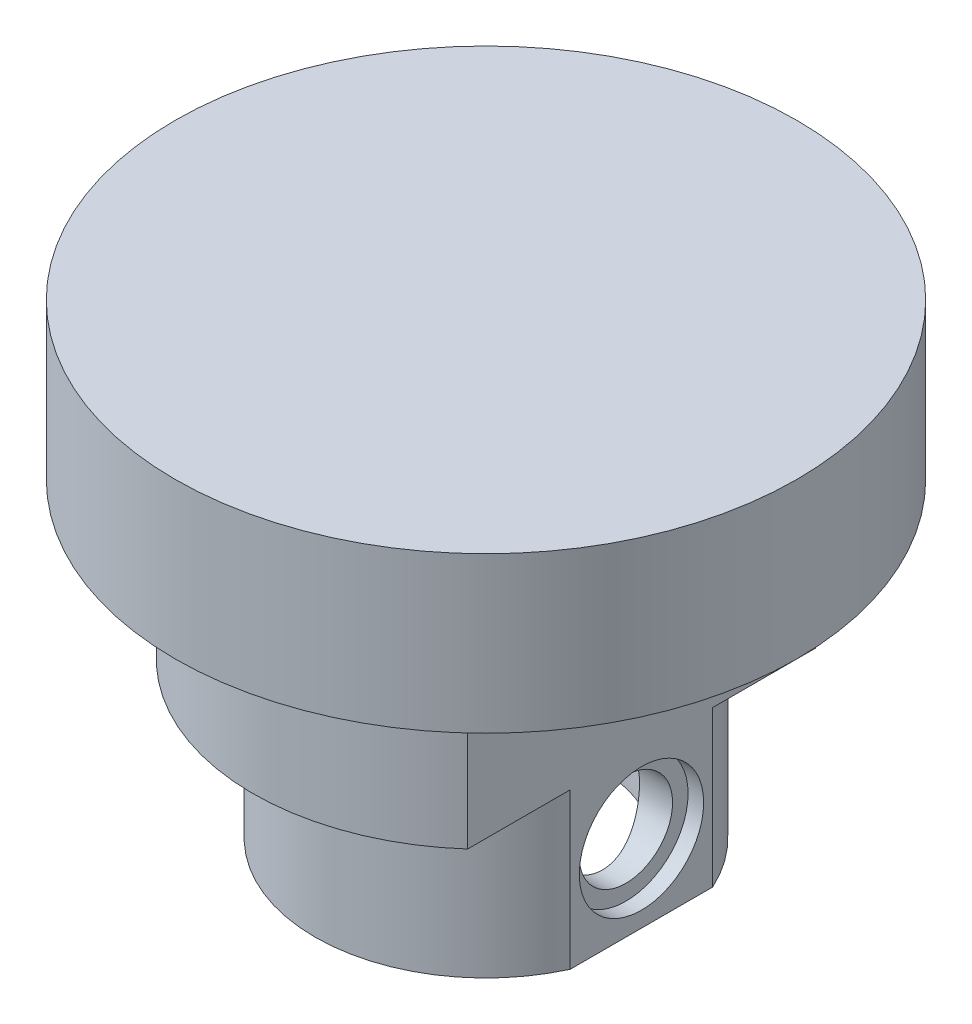
ISO-10303-21;
HEADER;
FILE_DESCRIPTION(('STEP AP214'),'2;1');
FILE_NAME('part.step','',(''),(''),'','','');
FILE_SCHEMA(('AUTOMOTIVE_DESIGN { 1 0 10303 214 1 1 1 1 }'));
ENDSEC;
DATA;
#1=APPLICATION_CONTEXT('core data for automotive mechanical design processes');
#2=APPLICATION_PROTOCOL_DEFINITION('international standard','automotive_design',2000,#1);
#3=PRODUCT_CONTEXT('',#1,'mechanical');
#4=PRODUCT('Part','Part','',(#3));
#5=PRODUCT_RELATED_PRODUCT_CATEGORY('part','',(#4));
#6=PRODUCT_DEFINITION_FORMATION('','',#4);
#7=PRODUCT_DEFINITION_CONTEXT('part definition',#1,'design');
#8=PRODUCT_DEFINITION('design','',#6,#7);
#9=PRODUCT_DEFINITION_SHAPE('','',#8);
#10=(LENGTH_UNIT() NAMED_UNIT(*) SI_UNIT(.MILLI.,.METRE.));
#11=(NAMED_UNIT(*) PLANE_ANGLE_UNIT() SI_UNIT($,.RADIAN.));
#12=(NAMED_UNIT(*) SI_UNIT($,.STERADIAN.) SOLID_ANGLE_UNIT());
#13=UNCERTAINTY_MEASURE_WITH_UNIT(LENGTH_MEASURE(1.E-05),#10,'distance_accuracy_value','');
#14=(GEOMETRIC_REPRESENTATION_CONTEXT(3) GLOBAL_UNCERTAINTY_ASSIGNED_CONTEXT((#13)) GLOBAL_UNIT_ASSIGNED_CONTEXT((#10,
#11,#12)) REPRESENTATION_CONTEXT('',''));
#15=CARTESIAN_POINT('',(0.,0.,0.));
#16=DIRECTION('',(0.,0.,1.));
#17=DIRECTION('',(1.,0.,0.));
#18=AXIS2_PLACEMENT_3D('',#15,#16,#17);
#19=CARTESIAN_POINT('',(-22.001,-25.,0.));
#20=DIRECTION('',(1.,0.,0.));
#21=DIRECTION('',(0.,0.,-1.));
#22=AXIS2_PLACEMENT_3D('',#19,#20,#21);
#23=CYLINDRICAL_SURFACE('',#22,3.);
#24=CARTESIAN_POINT('',(6.87386354243376,-25.,-3.));
#25=CARTESIAN_POINT('',(6.87387034169605,-25.1606855345694,-2.99999310102034));
#26=CARTESIAN_POINT('',(6.87957650695683,-25.3216394414978,-2.9870126033011));
#27=CARTESIAN_POINT('',(6.901666249599,-25.6389086261494,-2.93560066312235));
#28=CARTESIAN_POINT('',(6.9180771094252,-25.7952109815078,-2.89710418548511));
#29=CARTESIAN_POINT('',(6.95940616078833,-26.0980777134562,-2.79635331714323));
#30=CARTESIAN_POINT('',(6.98429226391323,-26.2446763649368,-2.73418843497826));
#31=CARTESIAN_POINT('',(7.0397201578331,-26.5253280322934,-2.58813019791229));
#32=CARTESIAN_POINT('',(7.07026071330917,-26.6593837787862,-2.5042415873656));
#33=CARTESIAN_POINT('',(7.13551292343503,-26.9188904718165,-2.31198302134881));
#34=CARTESIAN_POINT('',(7.17035875533908,-27.0435345990959,-2.20256905254827));
#35=CARTESIAN_POINT('',(7.23918686872916,-27.2732935312837,-1.96456364269823));
#36=CARTESIAN_POINT('',(7.27316884487642,-27.3784015115646,-1.83596552816021));
#37=CARTESIAN_POINT('',(7.33805111462092,-27.5701095854646,-1.55700947005955));
#38=CARTESIAN_POINT('',(7.36877705418855,-27.6558164495289,-1.40599344962864));
#39=CARTESIAN_POINT('',(7.42205891553774,-27.8002653552607,-1.09023798310296));
#40=CARTESIAN_POINT('',(7.44461816104874,-27.8590183693733,-0.925504153615326));
#41=CARTESIAN_POINT('',(7.47807487485913,-27.9450122289896,-0.595449640559632));
#42=CARTESIAN_POINT('',(7.48948405155942,-27.9736409709553,-0.430543477287476));
#43=CARTESIAN_POINT('',(7.50120466031146,-28.0030427286722,-0.0978994928759445));
#44=CARTESIAN_POINT('',(7.50152023155834,-28.0038261339487,0.0698372487591155));
#45=CARTESIAN_POINT('',(7.49132944230918,-27.9782758452937,0.393348742053132));
#46=CARTESIAN_POINT('',(7.48142995157228,-27.9534628408679,0.549266179305684));
#47=CARTESIAN_POINT('',(7.45273937203712,-27.8800106855455,0.854509663832869));
#48=CARTESIAN_POINT('',(7.43394763082012,-27.8313697864023,1.00383522658686));
#49=CARTESIAN_POINT('',(7.388952366862,-27.7110452756826,1.29434690776583));
#50=CARTESIAN_POINT('',(7.36264140699335,-27.6390254277769,1.43537643506834));
#51=CARTESIAN_POINT('',(7.30521877770412,-27.4743024896213,1.70371222611196));
#52=CARTESIAN_POINT('',(7.27410546400724,-27.3815923103498,1.83101376407694));
#53=CARTESIAN_POINT('',(7.20782455764184,-27.1710262960842,2.07715324198526));
#54=CARTESIAN_POINT('',(7.17252489767638,-27.0519191611408,2.19488676789948));
#55=CARTESIAN_POINT('',(7.10342491459894,-26.795514142252,2.40916112308897));
#56=CARTESIAN_POINT('',(7.06962508512115,-26.6582103277066,2.50569501568047));
#57=CARTESIAN_POINT('',(7.00645346113535,-26.3643714664391,2.67735628307891));
#58=CARTESIAN_POINT('',(6.97723371086562,-26.207402754492,2.75180197745439));
#59=CARTESIAN_POINT('',(6.92831385516127,-25.8816767645317,2.87276438979969));
#60=CARTESIAN_POINT('',(6.90860756836966,-25.7129272229101,2.91929924756697));
#61=CARTESIAN_POINT('',(6.88244639554074,-25.3794463337989,2.98043242328234));
#62=CARTESIAN_POINT('',(6.87525549684207,-25.2150993293072,2.99680814522181));
#63=CARTESIAN_POINT('',(6.87284246803558,-24.8858841883607,3.00234198966433));
#64=CARTESIAN_POINT('',(6.87761670840543,-24.7210162250865,2.99150836588693));
#65=CARTESIAN_POINT('',(6.8978406653867,-24.4053115975646,2.94454934218505));
#66=CARTESIAN_POINT('',(6.91266686697452,-24.2542105938999,2.90989959303579));
#67=CARTESIAN_POINT('',(6.9505507654101,-23.9600673928218,2.81820628036631));
#68=CARTESIAN_POINT('',(6.97361028732897,-23.8170269903393,2.76115775145341));
#69=CARTESIAN_POINT('',(7.02650672790152,-23.5365964633065,2.62370345922236));
#70=CARTESIAN_POINT('',(7.05658056958766,-23.3996707169582,2.54244430239697));
#71=CARTESIAN_POINT('',(7.11975577736692,-23.1407755188376,2.35974783666273));
#72=CARTESIAN_POINT('',(7.15285837344067,-23.0188121908068,2.25830231022284));
#73=CARTESIAN_POINT('',(7.22131373957124,-22.7839398871009,2.02926631752087));
#74=CARTESIAN_POINT('',(7.2566521092785,-22.6723651520626,1.90029814416816));
#75=CARTESIAN_POINT('',(7.32329691851298,-22.4722343850853,1.62462545005276));
#76=CARTESIAN_POINT('',(7.35460319389703,-22.3836792901073,1.47792020769992));
#77=CARTESIAN_POINT('',(7.40975573850585,-22.232428560305,1.17041990100452));
#78=CARTESIAN_POINT('',(7.4336037936099,-22.1697267337395,1.00962822149812));
#79=CARTESIAN_POINT('',(7.47109070203356,-22.0726767214004,0.678590386371823));
#80=CARTESIAN_POINT('',(7.48473509559155,-22.038313147884,0.50834941541523));
#81=CARTESIAN_POINT('',(7.49968512317788,-22.0007429475207,0.175224765543923));
#82=CARTESIAN_POINT('',(7.50173770124618,-21.995649807157,0.0125857389781306));
#83=CARTESIAN_POINT('',(7.49529063560582,-22.0117832190752,-0.311150753688398));
#84=CARTESIAN_POINT('',(7.48679258923161,-22.0330057872334,-0.472248449421579));
#85=CARTESIAN_POINT('',(7.46057270072754,-22.0998201819998,-0.783256352600094));
#86=CARTESIAN_POINT('',(7.44314221048496,-22.1446434171348,-0.9333582057973));
#87=CARTESIAN_POINT('',(7.40092421651037,-22.2565792088216,-1.2238835333139));
#88=CARTESIAN_POINT('',(7.37613535594289,-22.3236958764086,-1.36430521678368));
#89=CARTESIAN_POINT('',(7.32027141917801,-22.4816547900299,-1.63830455820773));
#90=CARTESIAN_POINT('',(7.288966960308,-22.5734144129877,-1.77130556278107));
#91=CARTESIAN_POINT('',(7.2238410334062,-22.7766828081205,-2.0205810602219));
#92=CARTESIAN_POINT('',(7.19001852696379,-22.8881997544123,-2.13684859379602));
#93=CARTESIAN_POINT('',(7.1210665105152,-23.135972720273,-2.35680182841674));
#94=CARTESIAN_POINT('',(7.08598570842144,-23.2733328627161,-2.45926306504163));
#95=CARTESIAN_POINT('',(7.02074485276124,-23.5644136535812,-2.63977144144724));
#96=CARTESIAN_POINT('',(6.99058537793172,-23.7181362226803,-2.71781571083651));
#97=CARTESIAN_POINT('',(6.94138371358595,-24.0235542797053,-2.84098572677451));
#98=CARTESIAN_POINT('',(6.92158645020622,-24.1741924040687,-2.88843803497901));
#99=CARTESIAN_POINT('',(6.89168739051179,-24.481733562239,-2.95907986392734));
#100=CARTESIAN_POINT('',(6.88155858435653,-24.6386178601365,-2.98233699287412));
#101=CARTESIAN_POINT('',(6.87587645913135,-24.8301673586673,-2.99538303278269));
#102=CARTESIAN_POINT('',(6.87512296675926,-24.8641022205346,-2.99711296127843));
#103=CARTESIAN_POINT('',(6.87411577084084,-24.9320207151958,-2.99942221686375));
#104=CARTESIAN_POINT('',(6.8738621039388,-24.9660043513827,-3.0000014595918));
#105=CARTESIAN_POINT('',(6.87386354243376,-25.,-3.));
#106=B_SPLINE_CURVE_WITH_KNOTS('',3,(#24,#25,#26,#27,#28,#29,#30,#31,#32,#33,#34,#35,#36,#37,
#38,#39,#40,#41,#42,#43,#44,#45,#46,#47,#48,#49,#50,#51,#52,#53,#54,#55,#56,#57,#58,#59,#60,#61,
#62,#63,#64,#65,#66,#67,#68,#69,#70,#71,#72,#73,#74,#75,#76,#77,#78,#79,#80,#81,#82,#83,#84,#85,
#86,#87,#88,#89,#90,#91,#92,#93,#94,#95,#96,#97,#98,#99,#100,#101,#102,#103,#104,#105),
.UNSPECIFIED.,.T.,.F.,(4,2,2,2,2,2,2,2,2,2,2,2,2,2,2,2,2,2,2,2,2,2,2,2,2,2,2,2,2,2,2,2,2,2,2,2,
2,2,2,2,4),(0.,0.481916473151481,0.965066003733366,1.44640623494008,1.92764143235791,
2.43383427426637,2.94020361522513,3.46654003637142,3.9926620045422,4.49331274330775,
4.99377667958508,5.46612967245453,5.93851732693589,6.41802450352347,6.89769622410046,
7.40886066122033,7.9201921069069,8.44596688075886,8.97139957200151,9.4647322128663,
9.95791522361909,10.4230087212772,10.8882053797746,11.3722673197905,11.8565267178877,
12.3765560137047,12.8966064727912,13.4165323096922,13.936175639312,14.4219155963393,
14.907582022689,15.3783299166503,15.8491646674288,16.3408057670989,16.8326507484631,
17.3549437992842,17.8772982263878,18.3527499122861,18.8268694532887,18.928819278144,
19.0307765770883),.UNSPECIFIED.);
#107=CARTESIAN_POINT('',(6.87386354243376,-25.,-3.));
#108=VERTEX_POINT('',#107);
#109=EDGE_CURVE('E108',#108,#108,#106,.T.);
#110=ORIENTED_EDGE('',*,*,#109,.T.);
#111=EDGE_LOOP('',(#110));
#112=FACE_BOUND('',#111,.T.);
#113=CARTESIAN_POINT('',(9.,-25.,0.));
#114=DIRECTION('',(1.,0.,0.));
#115=DIRECTION('',(0.,0.,-1.));
#116=AXIS2_PLACEMENT_3D('',#113,#114,#115);
#117=CIRCLE('',#116,3.);
#118=CARTESIAN_POINT('',(9.,-25.,-3.));
#119=VERTEX_POINT('',#118);
#120=EDGE_CURVE('E39',#119,#119,#117,.F.);
#121=ORIENTED_EDGE('',*,*,#120,.F.);
#122=EDGE_LOOP('',(#121));
#123=FACE_BOUND('',#122,.T.);
#124=ADVANCED_FACE('F35',(#112,#123),#23,.F.);
#125=CARTESIAN_POINT('',(0.,-77.134227919873,0.));
#126=DIRECTION('',(0.,1.,0.));
#127=DIRECTION('',(0.,0.,1.));
#128=AXIS2_PLACEMENT_3D('',#125,#126,#127);
#129=CYLINDRICAL_SURFACE('',#128,15.);
#130=CARTESIAN_POINT('',(0.,-20.,0.));
#131=DIRECTION('',(0.,1.,0.));
#132=DIRECTION('',(0.,0.,1.));
#133=AXIS2_PLACEMENT_3D('',#130,#131,#132);
#134=CIRCLE('',#133,15.);
#135=CARTESIAN_POINT('',(10.,-20.,11.1803398874989));
#136=VERTEX_POINT('',#135);
#137=CARTESIAN_POINT('',(10.,-20.,-11.1803398874989));
#138=VERTEX_POINT('',#137);
#139=EDGE_CURVE('E91',#136,#138,#134,.F.);
#140=ORIENTED_EDGE('',*,*,#139,.F.);
#141=DIRECTION('',(0.,1.,0.));
#142=VECTOR('',#141,1.);
#143=CARTESIAN_POINT('',(10.,-30.,11.1803398874989));
#144=LINE('',#143,#142);
#145=CARTESIAN_POINT('',(10.,-10.,11.1803398874989));
#146=VERTEX_POINT('',#145);
#147=EDGE_CURVE('E77',#136,#146,#144,.T.);
#148=ORIENTED_EDGE('',*,*,#147,.T.);
#149=CARTESIAN_POINT('',(0.,-10.,0.));
#150=DIRECTION('',(0.,1.,0.));
#151=DIRECTION('',(0.,0.,1.));
#152=AXIS2_PLACEMENT_3D('',#149,#150,#151);
#153=CIRCLE('',#152,15.);
#154=CARTESIAN_POINT('',(10.,-10.,-11.1803398874989));
#155=VERTEX_POINT('',#154);
#156=EDGE_CURVE('E89',#155,#146,#153,.T.);
#157=ORIENTED_EDGE('',*,*,#156,.F.);
#158=DIRECTION('',(0.,1.,0.));
#159=VECTOR('',#158,1.);
#160=CARTESIAN_POINT('',(10.,-30.,-11.1803398874989));
#161=LINE('',#160,#159);
#162=EDGE_CURVE('E80',#138,#155,#161,.T.);
#163=ORIENTED_EDGE('',*,*,#162,.F.);
#164=EDGE_LOOP('',(#140,#148,#157,#163));
#165=FACE_BOUND('',#164,.T.);
#166=ADVANCED_FACE('F88',(#165),#129,.T.);
#167=CARTESIAN_POINT('',(0.,-20.,0.));
#168=DIRECTION('',(0.,1.,0.));
#169=DIRECTION('',(0.,0.,1.));
#170=AXIS2_PLACEMENT_3D('',#167,#168,#169);
#171=PLANE('',#170);
#172=DIRECTION('',(0.,0.,-1.));
#173=VECTOR('',#172,1.);
#174=CARTESIAN_POINT('',(10.,-20.,0.));
#175=LINE('',#174,#173);
#176=CARTESIAN_POINT('',(10.,-20.,4.58257569495584));
#177=VERTEX_POINT('',#176);
#178=EDGE_CURVE('E183',#136,#177,#175,.T.);
#179=ORIENTED_EDGE('',*,*,#178,.F.);
#180=ORIENTED_EDGE('',*,*,#139,.T.);
#181=CARTESIAN_POINT('',(10.,-20.,-4.58257569495584));
#182=VERTEX_POINT('',#181);
#183=EDGE_CURVE('E182',#182,#138,#175,.T.);
#184=ORIENTED_EDGE('',*,*,#183,.F.);
#185=CARTESIAN_POINT('',(0.,-20.,0.));
#186=DIRECTION('',(0.,1.,0.));
#187=DIRECTION('',(0.,0.,1.));
#188=AXIS2_PLACEMENT_3D('',#185,#186,#187);
#189=CIRCLE('',#188,11.);
#190=EDGE_CURVE('E100',#182,#177,#189,.T.);
#191=ORIENTED_EDGE('',*,*,#190,.T.);
#192=EDGE_LOOP('',(#179,#180,#184,#191));
#193=FACE_BOUND('',#192,.T.);
#194=ADVANCED_FACE('F150',(#193),#171,.F.);
#195=CARTESIAN_POINT('',(0.,-30.,0.));
#196=DIRECTION('',(0.,1.,0.));
#197=DIRECTION('',(0.,0.,1.));
#198=AXIS2_PLACEMENT_3D('',#195,#196,#197);
#199=CYLINDRICAL_SURFACE('',#198,11.);
#200=CARTESIAN_POINT('',(-10.5830052442584,-25.,-3.));
#201=CARTESIAN_POINT('',(-10.583007958691,-25.1651129020577,-2.99999631394217));
#202=CARTESIAN_POINT('',(-10.5869115609735,-25.3302642199116,-2.9863224317348));
#203=CARTESIAN_POINT('',(-10.6020548381034,-25.6557870505994,-2.93209821184804));
#204=CARTESIAN_POINT('',(-10.6132979740766,-25.8161562709969,-2.8915351938393));
#205=CARTESIAN_POINT('',(-10.6417543479045,-26.1273583759239,-2.78497349245513));
#206=CARTESIAN_POINT('',(-10.6589589247646,-26.2782047218085,-2.71901169395373));
#207=CARTESIAN_POINT('',(-10.697388502605,-26.5667162684734,-2.56364148046498));
#208=CARTESIAN_POINT('',(-10.7186138680988,-26.7043802724746,-2.47423093939755));
#209=CARTESIAN_POINT('',(-10.7633157269056,-26.9662204135827,-2.27199971714033));
#210=CARTESIAN_POINT('',(-10.786833581786,-27.0900006567561,-2.15867548436929));
#211=CARTESIAN_POINT('',(-10.8331142058485,-27.317055315451,-1.9129160544093));
#212=CARTESIAN_POINT('',(-10.8558768934638,-27.420327521832,-1.78047880100251));
#213=CARTESIAN_POINT('',(-10.898545441737,-27.605097253621,-1.49749518483003));
#214=CARTESIAN_POINT('',(-10.9183968296209,-27.6861994436529,-1.3466817662362));
#215=CARTESIAN_POINT('',(-10.9525304511732,-27.8217457363657,-1.03292742411298));
#216=CARTESIAN_POINT('',(-10.9668136687404,-27.8761945491484,-0.869988649206008));
#217=CARTESIAN_POINT('',(-10.9879091215097,-27.9556021965611,-0.540742903696052));
#218=CARTESIAN_POINT('',(-10.994891791957,-27.9812348884295,-0.37460956683859));
#219=CARTESIAN_POINT('',(-11.0011960452895,-28.0044046045959,-0.0402637429495018));
#220=CARTESIAN_POINT('',(-11.0005189670801,-28.0019465390889,0.127948375581458));
#221=CARTESIAN_POINT('',(-10.9917041280665,-27.9694752027032,0.456980121405162));
#222=CARTESIAN_POINT('',(-10.9837635712747,-27.9401902533615,0.617877718859153));
#223=CARTESIAN_POINT('',(-10.9615478819394,-27.8560753353088,0.932382009793437));
#224=CARTESIAN_POINT('',(-10.9472723800974,-27.8012438773432,1.08598827764441));
#225=CARTESIAN_POINT('',(-10.9137017775887,-27.6670457283141,1.38338647378973));
#226=CARTESIAN_POINT('',(-10.8943566836113,-27.587433102625,1.52706155098294));
#227=CARTESIAN_POINT('',(-10.852725757155,-27.4061222114648,1.79925853732222));
#228=CARTESIAN_POINT('',(-10.8304393292169,-27.3044194712557,1.9277773681559));
#229=CARTESIAN_POINT('',(-10.784492415915,-27.07796400976,2.17036149751677));
#230=CARTESIAN_POINT('',(-10.7608107858484,-26.9525766561249,2.28383106523422));
#231=CARTESIAN_POINT('',(-10.715383975544,-26.6843095697668,2.48828152564665));
#232=CARTESIAN_POINT('',(-10.6936389249343,-26.5414286676029,2.57926091364812));
#233=CARTESIAN_POINT('',(-10.6544594320219,-26.2408912120183,2.73663009812325));
#234=CARTESIAN_POINT('',(-10.6370548781093,-26.0831419885318,2.80285088541272));
#235=CARTESIAN_POINT('',(-10.6088947081252,-25.7581547956234,2.90763299613952));
#236=CARTESIAN_POINT('',(-10.5981373556147,-25.5909193167561,2.94620154355457));
#237=CARTESIAN_POINT('',(-10.5848615034452,-25.2572956369516,2.99354252921381));
#238=CARTESIAN_POINT('',(-10.5820965560097,-25.0910436264504,3.00320658127149));
#239=CARTESIAN_POINT('',(-10.5844430221321,-24.7592977129114,2.99492665221736));
#240=CARTESIAN_POINT('',(-10.5895535533732,-24.5938037270327,2.97698576378154));
#241=CARTESIAN_POINT('',(-10.6068364060829,-24.2717551253858,2.91479275923711));
#242=CARTESIAN_POINT('',(-10.6188630043201,-24.1150871587427,2.87108313218805));
#243=CARTESIAN_POINT('',(-10.6484790285967,-23.8113079801365,2.75920663677019));
#244=CARTESIAN_POINT('',(-10.6660692054297,-23.664198061244,2.69103646733415));
#245=CARTESIAN_POINT('',(-10.7053313595423,-23.3799985836667,2.53038481558079));
#246=CARTESIAN_POINT('',(-10.7270874317935,-23.2432148509902,2.43738334790319));
#247=CARTESIAN_POINT('',(-10.7720352546733,-22.9868678692296,2.23034883245409));
#248=CARTESIAN_POINT('',(-10.7952272874441,-22.8673080197997,2.11631164274843));
#249=CARTESIAN_POINT('',(-10.8412873004258,-22.6450672720988,1.86630672600238));
#250=CARTESIAN_POINT('',(-10.8641239958047,-22.5430099931316,1.7297776950392));
#251=CARTESIAN_POINT('',(-10.9061791332427,-22.363258729818,1.44101111501377));
#252=CARTESIAN_POINT('',(-10.9253977677713,-22.2855634493444,1.28877440221759));
#253=CARTESIAN_POINT('',(-10.9579274645047,-22.1574658674842,0.973984676303821));
#254=CARTESIAN_POINT('',(-10.9712828319589,-22.106858219399,0.811520026490852));
#255=CARTESIAN_POINT('',(-10.9907764764024,-22.0337860949098,0.479971729445636));
#256=CARTESIAN_POINT('',(-10.9969164320813,-22.0113150723462,0.310889631247627));
#257=CARTESIAN_POINT('',(-11.0012041471382,-21.9955797598188,-0.0232794393640339));
#258=CARTESIAN_POINT('',(-10.9996016998911,-22.0014026573865,-0.188320818610347));
#259=CARTESIAN_POINT('',(-10.9891537057497,-22.03995955462,-0.514982609274361));
#260=CARTESIAN_POINT('',(-10.980308453419,-22.0726924598607,-0.676603159542358));
#261=CARTESIAN_POINT('',(-10.9564222583548,-22.1636147406788,-0.990684067393571));
#262=CARTESIAN_POINT('',(-10.9414282698753,-22.2216113964798,-1.14320402358952));
#263=CARTESIAN_POINT('',(-10.9068088184094,-22.3612432430709,-1.43643473924553));
#264=CARTESIAN_POINT('',(-10.8871826835111,-22.4428818636158,-1.57714378146592));
#265=CARTESIAN_POINT('',(-10.8447157469266,-22.6301094565608,-1.84697735038909));
#266=CARTESIAN_POINT('',(-10.821801074927,-22.7362981448634,-1.97567408641904));
#267=CARTESIAN_POINT('',(-10.77562687508,-22.9684842771104,-2.21372992386849));
#268=CARTESIAN_POINT('',(-10.7523672567304,-23.0944870059396,-2.32308384950928));
#269=CARTESIAN_POINT('',(-10.7075101554702,-23.3662550536282,-2.52187932121526));
#270=CARTESIAN_POINT('',(-10.685964021802,-23.5124124052277,-2.61079759566744));
#271=CARTESIAN_POINT('',(-10.6477131133895,-23.8181718901637,-2.76267612596911));
#272=CARTESIAN_POINT('',(-10.6310053132866,-23.9777655409837,-2.82565261339771));
#273=CARTESIAN_POINT('',(-10.6065296317478,-24.2805360385308,-2.91605222306044));
#274=CARTESIAN_POINT('',(-10.5977813362995,-24.4224569375099,-2.94745662446349));
#275=CARTESIAN_POINT('',(-10.5860183115613,-24.7095755957985,-2.98943081578313));
#276=CARTESIAN_POINT('',(-10.5830028567461,-24.8547729381006,-3.00000324211702));
#277=CARTESIAN_POINT('',(-10.5830052442584,-25.,-3.));
#278=B_SPLINE_CURVE_WITH_KNOTS('',3,(#200,#201,#202,#203,#204,#205,#206,#207,#208,#209,#210,
#211,#212,#213,#214,#215,#216,#217,#218,#219,#220,#221,#222,#223,#224,#225,#226,#227,#228,#229,
#230,#231,#232,#233,#234,#235,#236,#237,#238,#239,#240,#241,#242,#243,#244,#245,#246,#247,#248,
#249,#250,#251,#252,#253,#254,#255,#256,#257,#258,#259,#260,#261,#262,#263,#264,#265,#266,#267,
#268,#269,#270,#271,#272,#273,#274,#275,#276,#277),.UNSPECIFIED.,.T.,.F.,(4,2,2,2,2,2,2,2,2,2,2,
2,2,2,2,2,2,2,2,2,2,2,2,2,2,2,2,2,2,2,2,2,2,2,2,2,2,2,4),(0.,0.494804402783934,
0.989842310673484,1.48416400458282,1.9785305337777,2.48458654001651,2.99069702943608,
3.50531765639171,4.01984730833293,4.52207686042122,5.02421862536768,5.51311924771327,
6.0020483744866,6.49599339426235,6.99003856468468,7.49992833732446,8.00985221464116,
8.52319603663078,9.03640570178773,9.53361223089933,10.0307630603168,10.5178037490719,
11.0049101910351,11.5031485099097,12.0014850368415,12.5149711336561,13.0284299069195,
13.5379390354896,14.0473296015752,14.5403975209342,15.0334453883032,15.5227962513149,
16.0122181403599,16.5151701080202,17.0182564534142,17.5330636246647,18.0475481939114,
18.4828145157885,18.9180257484398),.UNSPECIFIED.);
#279=CARTESIAN_POINT('',(-10.5830052442584,-25.,-3.));
#280=VERTEX_POINT('',#279);
#281=EDGE_CURVE('E132',#280,#280,#278,.T.);
#282=ORIENTED_EDGE('',*,*,#281,.F.);
#283=EDGE_LOOP('',(#282));
#284=FACE_BOUND('',#283,.T.);
#285=ORIENTED_EDGE('',*,*,#190,.F.);
#286=DIRECTION('',(0.,1.,0.));
#287=VECTOR('',#286,1.);
#288=CARTESIAN_POINT('',(10.,-30.,-4.58257569495584));
#289=LINE('',#288,#287);
#290=CARTESIAN_POINT('',(10.,-30.,-4.58257569495584));
#291=VERTEX_POINT('',#290);
#292=EDGE_CURVE('E57',#182,#291,#289,.F.);
#293=ORIENTED_EDGE('',*,*,#292,.T.);
#294=CARTESIAN_POINT('',(0.,-30.,0.));
#295=DIRECTION('',(0.,1.,0.));
#296=DIRECTION('',(0.,0.,1.));
#297=AXIS2_PLACEMENT_3D('',#294,#295,#296);
#298=CIRCLE('',#297,11.);
#299=CARTESIAN_POINT('',(10.,-30.,4.58257569495584));
#300=VERTEX_POINT('',#299);
#301=EDGE_CURVE('E95',#291,#300,#298,.T.);
#302=ORIENTED_EDGE('',*,*,#301,.T.);
#303=DIRECTION('',(0.,1.,0.));
#304=VECTOR('',#303,1.);
#305=CARTESIAN_POINT('',(10.,-30.,4.58257569495584));
#306=LINE('',#305,#304);
#307=EDGE_CURVE('E51',#300,#177,#306,.T.);
#308=ORIENTED_EDGE('',*,*,#307,.T.);
#309=EDGE_LOOP('',(#285,#293,#302,#308));
#310=FACE_BOUND('',#309,.T.);
#311=ADVANCED_FACE('F144',(#284,#310),#199,.T.);
#312=CARTESIAN_POINT('',(0.,-30.,0.));
#313=DIRECTION('',(0.,1.,0.));
#314=DIRECTION('',(0.,0.,1.));
#315=AXIS2_PLACEMENT_3D('',#312,#313,#314);
#316=PLANE('',#315);
#317=CARTESIAN_POINT('',(0.,-30.,0.));
#318=DIRECTION('',(0.,1.,0.));
#319=DIRECTION('',(0.,0.,1.));
#320=AXIS2_PLACEMENT_3D('',#317,#318,#319);
#321=CIRCLE('',#320,7.5);
#322=CARTESIAN_POINT('',(0.,-30.,7.5));
#323=VERTEX_POINT('',#322);
#324=EDGE_CURVE('E140',#323,#323,#321,.T.);
#325=ORIENTED_EDGE('',*,*,#324,.T.);
#326=EDGE_LOOP('',(#325));
#327=FACE_BOUND('',#326,.T.);
#328=DIRECTION('',(0.,0.,-1.));
#329=VECTOR('',#328,1.);
#330=CARTESIAN_POINT('',(10.,-30.,0.));
#331=LINE('',#330,#329);
#332=EDGE_CURVE('E13',#300,#291,#331,.T.);
#333=ORIENTED_EDGE('',*,*,#332,.F.);
#334=ORIENTED_EDGE('',*,*,#301,.F.);
#335=EDGE_LOOP('',(#333,#334));
#336=FACE_BOUND('',#335,.T.);
#337=ADVANCED_FACE('F149',(#327,#336),#316,.F.);
#338=CARTESIAN_POINT('',(0.,-20.,0.));
#339=DIRECTION('',(0.,1.,0.));
#340=DIRECTION('',(0.,0.,1.));
#341=AXIS2_PLACEMENT_3D('',#338,#339,#340);
#342=CYLINDRICAL_SURFACE('',#341,20.);
#343=CARTESIAN_POINT('',(0.,-10.,0.));
#344=DIRECTION('',(0.,1.,0.));
#345=DIRECTION('',(0.,0.,1.));
#346=AXIS2_PLACEMENT_3D('',#343,#344,#345);
#347=CIRCLE('',#346,20.);
#348=CARTESIAN_POINT('',(0.,-10.,20.));
#349=VERTEX_POINT('',#348);
#350=EDGE_CURVE('E97',#349,#349,#347,.F.);
#351=ORIENTED_EDGE('',*,*,#350,.F.);
#352=EDGE_LOOP('',(#351));
#353=FACE_BOUND('',#352,.T.);
#354=CARTESIAN_POINT('',(0.,0.,0.));
#355=DIRECTION('',(0.,1.,0.));
#356=DIRECTION('',(0.,0.,1.));
#357=AXIS2_PLACEMENT_3D('',#354,#355,#356);
#358=CIRCLE('',#357,20.);
#359=CARTESIAN_POINT('',(0.,0.,20.));
#360=VERTEX_POINT('',#359);
#361=EDGE_CURVE('E44',#360,#360,#358,.T.);
#362=ORIENTED_EDGE('',*,*,#361,.F.);
#363=EDGE_LOOP('',(#362));
#364=FACE_BOUND('',#363,.T.);
#365=ADVANCED_FACE('F37',(#353,#364),#342,.T.);
#366=CARTESIAN_POINT('',(0.,0.,0.));
#367=DIRECTION('',(0.,1.,0.));
#368=DIRECTION('',(0.,0.,1.));
#369=AXIS2_PLACEMENT_3D('',#366,#367,#368);
#370=PLANE('',#369);
#371=ORIENTED_EDGE('',*,*,#361,.T.);
#372=EDGE_LOOP('',(#371));
#373=FACE_BOUND('',#372,.T.);
#374=ADVANCED_FACE('F157',(#373),#370,.T.);
#375=CARTESIAN_POINT('',(0.,-10.,0.));
#376=DIRECTION('',(0.,1.,0.));
#377=DIRECTION('',(0.,0.,1.));
#378=AXIS2_PLACEMENT_3D('',#375,#376,#377);
#379=PLANE('',#378);
#380=ORIENTED_EDGE('',*,*,#156,.T.);
#381=DIRECTION('',(0.,0.,-1.));
#382=VECTOR('',#381,1.);
#383=CARTESIAN_POINT('',(10.,-10.,0.));
#384=LINE('',#383,#382);
#385=EDGE_CURVE('E74',#146,#155,#384,.T.);
#386=ORIENTED_EDGE('',*,*,#385,.T.);
#387=EDGE_LOOP('',(#380,#386));
#388=FACE_BOUND('',#387,.T.);
#389=ORIENTED_EDGE('',*,*,#350,.T.);
#390=EDGE_LOOP('',(#389));
#391=FACE_BOUND('',#390,.T.);
#392=ADVANCED_FACE('F93',(#388,#391),#379,.F.);
#393=CARTESIAN_POINT('',(10.,-30.,0.));
#394=DIRECTION('',(1.,0.,0.));
#395=DIRECTION('',(0.,0.,-1.));
#396=AXIS2_PLACEMENT_3D('',#393,#394,#395);
#397=PLANE('',#396);
#398=CARTESIAN_POINT('',(10.,-25.,0.));
#399=DIRECTION('',(1.,0.,0.));
#400=DIRECTION('',(0.,0.,-1.));
#401=AXIS2_PLACEMENT_3D('',#398,#399,#400);
#402=CIRCLE('',#401,4.);
#403=CARTESIAN_POINT('',(10.,-25.,-4.));
#404=VERTEX_POINT('',#403);
#405=EDGE_CURVE('E141',#404,#404,#402,.T.);
#406=ORIENTED_EDGE('',*,*,#405,.F.);
#407=EDGE_LOOP('',(#406));
#408=FACE_BOUND('',#407,.T.);
#409=ORIENTED_EDGE('',*,*,#183,.T.);
#410=ORIENTED_EDGE('',*,*,#162,.T.);
#411=ORIENTED_EDGE('',*,*,#385,.F.);
#412=ORIENTED_EDGE('',*,*,#147,.F.);
#413=ORIENTED_EDGE('',*,*,#178,.T.);
#414=ORIENTED_EDGE('',*,*,#307,.F.);
#415=ORIENTED_EDGE('',*,*,#332,.T.);
#416=ORIENTED_EDGE('',*,*,#292,.F.);
#417=EDGE_LOOP('',(#409,#410,#411,#412,#413,#414,#415,#416));
#418=FACE_BOUND('',#417,.T.);
#419=ADVANCED_FACE('F76',(#408,#418),#397,.T.);
#420=CARTESIAN_POINT('',(0.,21.2132034355964,0.));
#421=DIRECTION('',(0.,-1.,0.));
#422=DIRECTION('',(0.,0.,-1.));
#423=AXIS2_PLACEMENT_3D('',#420,#421,#422);
#424=CYLINDRICAL_SURFACE('',#423,7.5);
#425=CARTESIAN_POINT('',(-6.87386354243376,-25.,-3.));
#426=CARTESIAN_POINT('',(-6.87387034169605,-24.8393144654306,-2.99999310102034));
#427=CARTESIAN_POINT('',(-6.87957650695683,-24.6783605585022,-2.9870126033011));
#428=CARTESIAN_POINT('',(-6.901666249599,-24.3610913738506,-2.93560066312235));
#429=CARTESIAN_POINT('',(-6.9180771094252,-24.2047890184922,-2.89710418548511));
#430=CARTESIAN_POINT('',(-6.95940616078833,-23.9019222865438,-2.79635331714323));
#431=CARTESIAN_POINT('',(-6.98429226391323,-23.7553236350632,-2.73418843497826));
#432=CARTESIAN_POINT('',(-7.0397201578331,-23.4746719677066,-2.58813019791229));
#433=CARTESIAN_POINT('',(-7.07026071330917,-23.3406162212138,-2.5042415873656));
#434=CARTESIAN_POINT('',(-7.13551292343503,-23.0811095281835,-2.31198302134881));
#435=CARTESIAN_POINT('',(-7.17035875533908,-22.9564654009041,-2.20256905254827));
#436=CARTESIAN_POINT('',(-7.23918686872916,-22.7267064687163,-1.96456364269823));
#437=CARTESIAN_POINT('',(-7.27316884487642,-22.6215984884354,-1.83596552816021));
#438=CARTESIAN_POINT('',(-7.33805111462092,-22.4298904145354,-1.55700947005955));
#439=CARTESIAN_POINT('',(-7.36877705418855,-22.3441835504711,-1.40599344962864));
#440=CARTESIAN_POINT('',(-7.42205891553774,-22.1997346447393,-1.09023798310296));
#441=CARTESIAN_POINT('',(-7.44461816104874,-22.1409816306267,-0.925504153615326));
#442=CARTESIAN_POINT('',(-7.47807487485913,-22.0549877710104,-0.595449640559632));
#443=CARTESIAN_POINT('',(-7.48948405155942,-22.0263590290447,-0.430543477287476));
#444=CARTESIAN_POINT('',(-7.50120466031146,-21.9969572713278,-0.0978994928759445));
#445=CARTESIAN_POINT('',(-7.50152023155834,-21.9961738660513,0.0698372487591155));
#446=CARTESIAN_POINT('',(-7.49132944230918,-22.0217241547063,0.393348742053131));
#447=CARTESIAN_POINT('',(-7.48142995157228,-22.0465371591321,0.549266179305683));
#448=CARTESIAN_POINT('',(-7.45273937203712,-22.1199893144545,0.854509663832868));
#449=CARTESIAN_POINT('',(-7.43394763082012,-22.1686302135977,1.00383522658686));
#450=CARTESIAN_POINT('',(-7.388952366862,-22.2889547243174,1.29434690776584));
#451=CARTESIAN_POINT('',(-7.36264140699335,-22.3609745722231,1.43537643506834));
#452=CARTESIAN_POINT('',(-7.30521877770412,-22.5256975103787,1.70371222611197));
#453=CARTESIAN_POINT('',(-7.27410546400724,-22.6184076896503,1.83101376407694));
#454=CARTESIAN_POINT('',(-7.20782455764184,-22.8289737039158,2.07715324198526));
#455=CARTESIAN_POINT('',(-7.17252489767638,-22.9480808388592,2.19488676789948));
#456=CARTESIAN_POINT('',(-7.10342491459894,-23.204485857748,2.40916112308897));
#457=CARTESIAN_POINT('',(-7.06962508512115,-23.3417896722934,2.50569501568047));
#458=CARTESIAN_POINT('',(-7.00645346113535,-23.6356285335609,2.67735628307891));
#459=CARTESIAN_POINT('',(-6.97723371086562,-23.792597245508,2.75180197745439));
#460=CARTESIAN_POINT('',(-6.92831385516127,-24.1183232354683,2.87276438979969));
#461=CARTESIAN_POINT('',(-6.90860756836966,-24.2870727770899,2.91929924756697));
#462=CARTESIAN_POINT('',(-6.88244639554074,-24.6205536662012,2.98043242328234));
#463=CARTESIAN_POINT('',(-6.87525549684207,-24.7849006706928,2.99680814522181));
#464=CARTESIAN_POINT('',(-6.87284246803558,-25.1141158116393,3.00234198966433));
#465=CARTESIAN_POINT('',(-6.87761670840543,-25.2789837749135,2.99150836588693));
#466=CARTESIAN_POINT('',(-6.8978406653867,-25.5946884024354,2.94454934218505));
#467=CARTESIAN_POINT('',(-6.91266686697452,-25.7457894061001,2.90989959303579));
#468=CARTESIAN_POINT('',(-6.9505507654101,-26.0399326071782,2.81820628036631));
#469=CARTESIAN_POINT('',(-6.97361028732897,-26.1829730096607,2.76115775145342));
#470=CARTESIAN_POINT('',(-7.02650672790152,-26.4634035366935,2.62370345922236));
#471=CARTESIAN_POINT('',(-7.05658056958766,-26.6003292830418,2.54244430239697));
#472=CARTESIAN_POINT('',(-7.11975577736692,-26.8592244811624,2.35974783666273));
#473=CARTESIAN_POINT('',(-7.15285837344067,-26.9811878091932,2.25830231022284));
#474=CARTESIAN_POINT('',(-7.22131373957124,-27.2160601128991,2.02926631752087));
#475=CARTESIAN_POINT('',(-7.2566521092785,-27.3276348479374,1.90029814416816));
#476=CARTESIAN_POINT('',(-7.32329691851298,-27.5277656149147,1.62462545005276));
#477=CARTESIAN_POINT('',(-7.35460319389703,-27.6163207098927,1.47792020769992));
#478=CARTESIAN_POINT('',(-7.40975573850585,-27.767571439695,1.17041990100452));
#479=CARTESIAN_POINT('',(-7.4336037936099,-27.8302732662605,1.00962822149812));
#480=CARTESIAN_POINT('',(-7.47109070203356,-27.9273232785996,0.678590386371823));
#481=CARTESIAN_POINT('',(-7.48473509559155,-27.961686852116,0.50834941541523));
#482=CARTESIAN_POINT('',(-7.49968512317788,-27.9992570524793,0.175224765543923));
#483=CARTESIAN_POINT('',(-7.50173770124618,-28.004350192843,0.0125857389781306));
#484=CARTESIAN_POINT('',(-7.49529063560582,-27.9882167809248,-0.311150753688398));
#485=CARTESIAN_POINT('',(-7.48679258923161,-27.9669942127666,-0.472248449421579));
#486=CARTESIAN_POINT('',(-7.46057270072754,-27.9001798180002,-0.783256352600094));
#487=CARTESIAN_POINT('',(-7.44314221048496,-27.8553565828652,-0.9333582057973));
#488=CARTESIAN_POINT('',(-7.40092421651037,-27.7434207911784,-1.2238835333139));
#489=CARTESIAN_POINT('',(-7.37613535594289,-27.6763041235914,-1.36430521678368));
#490=CARTESIAN_POINT('',(-7.32027141917801,-27.5183452099702,-1.63830455820773));
#491=CARTESIAN_POINT('',(-7.288966960308,-27.4265855870123,-1.77130556278107));
#492=CARTESIAN_POINT('',(-7.2238410334062,-27.2233171918795,-2.0205810602219));
#493=CARTESIAN_POINT('',(-7.19001852696379,-27.1118002455877,-2.13684859379602));
#494=CARTESIAN_POINT('',(-7.1210665105152,-26.864027279727,-2.35680182841674));
#495=CARTESIAN_POINT('',(-7.08598570842144,-26.7266671372839,-2.45926306504163));
#496=CARTESIAN_POINT('',(-7.02074485276124,-26.4355863464188,-2.63977144144724));
#497=CARTESIAN_POINT('',(-6.99058537793172,-26.2818637773197,-2.71781571083651));
#498=CARTESIAN_POINT('',(-6.94138371358595,-25.9764457202947,-2.84098572677451));
#499=CARTESIAN_POINT('',(-6.92158645020622,-25.8258075959313,-2.88843803497901));
#500=CARTESIAN_POINT('',(-6.89168739051179,-25.518266437761,-2.95907986392734));
#501=CARTESIAN_POINT('',(-6.88155858435653,-25.3613821398635,-2.98233699287412));
#502=CARTESIAN_POINT('',(-6.87587645913135,-25.1698326413327,-2.99538303278269));
#503=CARTESIAN_POINT('',(-6.87512296675926,-25.1358977794653,-2.99711296127843));
#504=CARTESIAN_POINT('',(-6.87411577084084,-25.0679792848042,-2.99942221686375));
#505=CARTESIAN_POINT('',(-6.8738621039388,-25.0339956486173,-3.0000014595918));
#506=CARTESIAN_POINT('',(-6.87386354243376,-25.,-3.));
#507=B_SPLINE_CURVE_WITH_KNOTS('',3,(#425,#426,#427,#428,#429,#430,#431,#432,#433,#434,#435,
#436,#437,#438,#439,#440,#441,#442,#443,#444,#445,#446,#447,#448,#449,#450,#451,#452,#453,#454,
#455,#456,#457,#458,#459,#460,#461,#462,#463,#464,#465,#466,#467,#468,#469,#470,#471,#472,#473,
#474,#475,#476,#477,#478,#479,#480,#481,#482,#483,#484,#485,#486,#487,#488,#489,#490,#491,#492,
#493,#494,#495,#496,#497,#498,#499,#500,#501,#502,#503,#504,#505,#506),.UNSPECIFIED.,.T.,.F.,(4,
2,2,2,2,2,2,2,2,2,2,2,2,2,2,2,2,2,2,2,2,2,2,2,2,2,2,2,2,2,2,2,2,2,2,2,2,2,2,2,4),(0.,
0.481916473151478,0.965066003733366,1.44640623494008,1.92764143235791,2.43383427426636,
2.94020361522513,3.46654003637142,3.9926620045422,4.49331274330775,4.99377667958508,
5.46612967245453,5.93851732693589,6.41802450352347,6.89769622410046,7.40886066122033,
7.9201921069069,8.44596688075886,8.97139957200151,9.4647322128663,9.95791522361909,
10.4230087212772,10.8882053797746,11.3722673197905,11.8565267178877,12.3765560137047,
12.8966064727912,13.4165323096922,13.936175639312,14.4219155963393,14.907582022689,
15.3783299166503,15.8491646674288,16.3408057670989,16.8326507484631,17.3549437992842,
17.8772982263878,18.3527499122861,18.8268694532887,18.928819278144,19.0307765770883),.UNSPECIFIED.);
#508=CARTESIAN_POINT('',(-6.87386354243376,-25.,-3.));
#509=VERTEX_POINT('',#508);
#510=EDGE_CURVE('E115',#509,#509,#507,.T.);
#511=ORIENTED_EDGE('',*,*,#510,.F.);
#512=EDGE_LOOP('',(#511));
#513=FACE_BOUND('',#512,.T.);
#514=ORIENTED_EDGE('',*,*,#109,.F.);
#515=EDGE_LOOP('',(#514));
#516=FACE_BOUND('',#515,.T.);
#517=ORIENTED_EDGE('',*,*,#324,.F.);
#518=EDGE_LOOP('',(#517));
#519=FACE_BOUND('',#518,.T.);
#520=CARTESIAN_POINT('',(0.,-4.99999999999999,0.));
#521=DIRECTION('',(0.,1.,0.));
#522=DIRECTION('',(0.,0.,1.));
#523=AXIS2_PLACEMENT_3D('',#520,#521,#522);
#524=CIRCLE('',#523,7.5);
#525=CARTESIAN_POINT('',(0.,-4.99999999999999,7.5));
#526=VERTEX_POINT('',#525);
#527=EDGE_CURVE('E84',#526,#526,#524,.T.);
#528=ORIENTED_EDGE('',*,*,#527,.T.);
#529=EDGE_LOOP('',(#528));
#530=FACE_BOUND('',#529,.T.);
#531=ADVANCED_FACE('F119',(#513,#516,#519,#530),#424,.F.);
#532=CARTESIAN_POINT('',(0.,-4.99999999999999,0.));
#533=DIRECTION('',(0.,1.,0.));
#534=DIRECTION('',(0.,0.,1.));
#535=AXIS2_PLACEMENT_3D('',#532,#533,#534);
#536=PLANE('',#535);
#537=ORIENTED_EDGE('',*,*,#527,.F.);
#538=EDGE_LOOP('',(#537));
#539=FACE_BOUND('',#538,.T.);
#540=ADVANCED_FACE('F192',(#539),#536,.F.);
#541=ORIENTED_EDGE('',*,*,#281,.T.);
#542=EDGE_LOOP('',(#541));
#543=FACE_BOUND('',#542,.T.);
#544=ORIENTED_EDGE('',*,*,#510,.T.);
#545=EDGE_LOOP('',(#544));
#546=FACE_BOUND('',#545,.T.);
#547=ADVANCED_FACE('F126',(#543,#546),#23,.F.);
#548=CARTESIAN_POINT('',(9.,-25.,0.));
#549=DIRECTION('',(1.,0.,0.));
#550=DIRECTION('',(0.,0.,-1.));
#551=AXIS2_PLACEMENT_3D('',#548,#549,#550);
#552=PLANE('',#551);
#553=CARTESIAN_POINT('',(9.,-25.,0.));
#554=DIRECTION('',(1.,0.,0.));
#555=DIRECTION('',(0.,0.,-1.));
#556=AXIS2_PLACEMENT_3D('',#553,#554,#555);
#557=CIRCLE('',#556,4.);
#558=CARTESIAN_POINT('',(9.,-25.,-4.));
#559=VERTEX_POINT('',#558);
#560=EDGE_CURVE('E208',#559,#559,#557,.T.);
#561=ORIENTED_EDGE('',*,*,#560,.T.);
#562=EDGE_LOOP('',(#561));
#563=FACE_BOUND('',#562,.T.);
#564=ORIENTED_EDGE('',*,*,#120,.T.);
#565=EDGE_LOOP('',(#564));
#566=FACE_BOUND('',#565,.T.);
#567=ADVANCED_FACE('F198',(#563,#566),#552,.T.);
#568=CARTESIAN_POINT('',(9.,-25.,0.));
#569=DIRECTION('',(1.,0.,0.));
#570=DIRECTION('',(0.,0.,-1.));
#571=AXIS2_PLACEMENT_3D('',#568,#569,#570);
#572=CYLINDRICAL_SURFACE('',#571,4.);
#573=ORIENTED_EDGE('',*,*,#560,.F.);
#574=EDGE_LOOP('',(#573));
#575=FACE_BOUND('',#574,.T.);
#576=ORIENTED_EDGE('',*,*,#405,.T.);
#577=EDGE_LOOP('',(#576));
#578=FACE_BOUND('',#577,.T.);
#579=ADVANCED_FACE('F127',(#575,#578),#572,.F.);
#580=CLOSED_SHELL('',(#124,#166,#194,#311,#337,#365,#374,#392,#419,#531,#540,#547,#567,#579));
#581=MANIFOLD_SOLID_BREP('B2',#580);
#582=ADVANCED_BREP_SHAPE_REPRESENTATION('',(#18,#581),#14);
#583=SHAPE_DEFINITION_REPRESENTATION(#9,#582);
ENDSEC;
END-ISO-10303-21;
